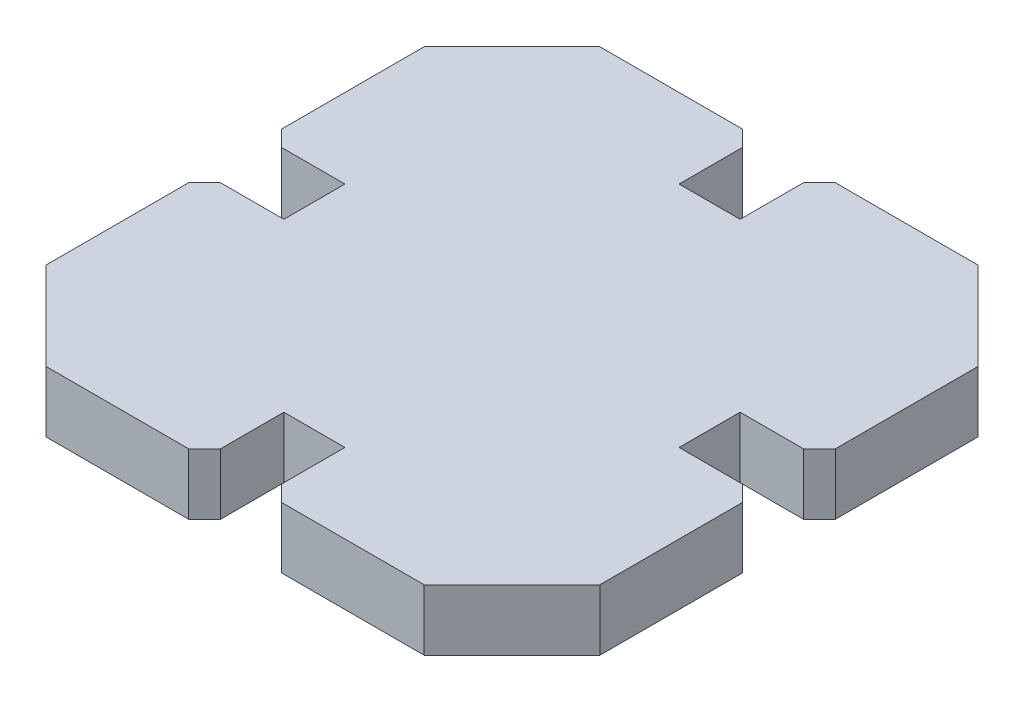
ISO-10303-21;
HEADER;
FILE_DESCRIPTION(('STEP AP214'),'2;1');
FILE_NAME('part.step','',(''),(''),'','','');
FILE_SCHEMA(('AUTOMOTIVE_DESIGN { 1 0 10303 214 1 1 1 1 }'));
ENDSEC;
DATA;
#1=APPLICATION_CONTEXT('core data for automotive mechanical design processes');
#2=APPLICATION_PROTOCOL_DEFINITION('international standard','automotive_design',2000,#1);
#3=PRODUCT_CONTEXT('',#1,'mechanical');
#4=PRODUCT('Part','Part','',(#3));
#5=PRODUCT_RELATED_PRODUCT_CATEGORY('part','',(#4));
#6=PRODUCT_DEFINITION_FORMATION('','',#4);
#7=PRODUCT_DEFINITION_CONTEXT('part definition',#1,'design');
#8=PRODUCT_DEFINITION('design','',#6,#7);
#9=PRODUCT_DEFINITION_SHAPE('','',#8);
#10=(LENGTH_UNIT() NAMED_UNIT(*) SI_UNIT(.MILLI.,.METRE.));
#11=(NAMED_UNIT(*) PLANE_ANGLE_UNIT() SI_UNIT($,.RADIAN.));
#12=(NAMED_UNIT(*) SI_UNIT($,.STERADIAN.) SOLID_ANGLE_UNIT());
#13=UNCERTAINTY_MEASURE_WITH_UNIT(LENGTH_MEASURE(1.E-05),#10,'distance_accuracy_value','');
#14=(GEOMETRIC_REPRESENTATION_CONTEXT(3) GLOBAL_UNCERTAINTY_ASSIGNED_CONTEXT((#13)) GLOBAL_UNIT_ASSIGNED_CONTEXT((#10,
#11,#12)) REPRESENTATION_CONTEXT('',''));
#15=CARTESIAN_POINT('',(0.,0.,0.));
#16=DIRECTION('',(0.,0.,1.));
#17=DIRECTION('',(1.,0.,0.));
#18=AXIS2_PLACEMENT_3D('',#15,#16,#17);
#19=CARTESIAN_POINT('',(11.925,3.85,-17.4607608695652));
#20=DIRECTION('',(-0.707106781186549,0.,0.707106781186546));
#21=DIRECTION('',(0.707106781186546,0.,0.707106781186549));
#22=AXIS2_PLACEMENT_3D('',#19,#20,#21);
#23=PLANE('',#22);
#24=DIRECTION('',(-0.707106781186546,0.,-0.707106781186549));
#25=VECTOR('',#24,1.);
#26=CARTESIAN_POINT('',(11.925,0.,-17.4607608695652));
#27=LINE('',#26,#25);
#28=CARTESIAN_POINT('',(17.4607608695652,0.,-11.9249999999999));
#29=VERTEX_POINT('',#28);
#30=CARTESIAN_POINT('',(11.925,0.,-17.4607608695652));
#31=VERTEX_POINT('',#30);
#32=EDGE_CURVE('E265',#29,#31,#27,.T.);
#33=ORIENTED_EDGE('',*,*,#32,.T.);
#34=DIRECTION('',(0.,-1.,0.));
#35=VECTOR('',#34,1.);
#36=CARTESIAN_POINT('',(11.925,3.85,-17.4607608695652));
#37=LINE('',#36,#35);
#38=CARTESIAN_POINT('',(11.925,3.85,-17.4607608695652));
#39=VERTEX_POINT('',#38);
#40=EDGE_CURVE('E248',#39,#31,#37,.T.);
#41=ORIENTED_EDGE('',*,*,#40,.F.);
#42=DIRECTION('',(-0.707106781186546,0.,-0.707106781186549));
#43=VECTOR('',#42,1.);
#44=CARTESIAN_POINT('',(11.925,3.85,-17.4607608695652));
#45=LINE('',#44,#43);
#46=CARTESIAN_POINT('',(17.4607608695652,3.85,-11.9249999999999));
#47=VERTEX_POINT('',#46);
#48=EDGE_CURVE('E253',#47,#39,#45,.T.);
#49=ORIENTED_EDGE('',*,*,#48,.F.);
#50=DIRECTION('',(0.,-1.,0.));
#51=VECTOR('',#50,1.);
#52=CARTESIAN_POINT('',(17.4607608695652,3.85,-11.9249999999999));
#53=LINE('',#52,#51);
#54=EDGE_CURVE('E403',#47,#29,#53,.T.);
#55=ORIENTED_EDGE('',*,*,#54,.T.);
#56=EDGE_LOOP('',(#33,#41,#49,#55));
#57=FACE_BOUND('',#56,.T.);
#58=ADVANCED_FACE('F33',(#57),#23,.F.);
#59=CARTESIAN_POINT('',(1.92499999999999,3.85,-17.4607608695652));
#60=DIRECTION('',(0.,0.,1.));
#61=DIRECTION('',(1.,0.,0.));
#62=AXIS2_PLACEMENT_3D('',#59,#60,#61);
#63=PLANE('',#62);
#64=DIRECTION('',(-1.,0.,0.));
#65=VECTOR('',#64,1.);
#66=CARTESIAN_POINT('',(1.92499999999999,0.,-17.4607608695652));
#67=LINE('',#66,#65);
#68=CARTESIAN_POINT('',(2.92499999999999,0.,-17.4607608695652));
#69=VERTEX_POINT('',#68);
#70=EDGE_CURVE('E352',#31,#69,#67,.T.);
#71=ORIENTED_EDGE('',*,*,#70,.T.);
#72=DIRECTION('',(0.,1.,0.));
#73=VECTOR('',#72,1.);
#74=CARTESIAN_POINT('',(2.92499999999999,3.85,-17.4607608695652));
#75=LINE('',#74,#73);
#76=CARTESIAN_POINT('',(2.92499999999999,3.85,-17.4607608695652));
#77=VERTEX_POINT('',#76);
#78=EDGE_CURVE('E11',#69,#77,#75,.T.);
#79=ORIENTED_EDGE('',*,*,#78,.T.);
#80=DIRECTION('',(-1.,0.,0.));
#81=VECTOR('',#80,1.);
#82=CARTESIAN_POINT('',(1.92499999999999,3.85,-17.4607608695652));
#83=LINE('',#82,#81);
#84=EDGE_CURVE('E243',#39,#77,#83,.T.);
#85=ORIENTED_EDGE('',*,*,#84,.F.);
#86=ORIENTED_EDGE('',*,*,#40,.T.);
#87=EDGE_LOOP('',(#71,#79,#85,#86));
#88=FACE_BOUND('',#87,.T.);
#89=ADVANCED_FACE('F246',(#88),#63,.F.);
#90=CARTESIAN_POINT('',(1.92499999999999,3.85,-17.4607608695652));
#91=DIRECTION('',(1.,0.,0.));
#92=DIRECTION('',(0.,0.,-1.));
#93=AXIS2_PLACEMENT_3D('',#90,#91,#92);
#94=PLANE('',#93);
#95=DIRECTION('',(0.,0.,1.));
#96=VECTOR('',#95,1.);
#97=CARTESIAN_POINT('',(1.92499999999999,3.85,-17.4607608695652));
#98=LINE('',#97,#96);
#99=CARTESIAN_POINT('',(1.92500000000007,3.85,-16.4607608695653));
#100=VERTEX_POINT('',#99);
#101=CARTESIAN_POINT('',(1.92500000000037,3.85,-12.4607608695653));
#102=VERTEX_POINT('',#101);
#103=EDGE_CURVE('E252',#100,#102,#98,.T.);
#104=ORIENTED_EDGE('',*,*,#103,.F.);
#105=DIRECTION('',(0.,-1.,0.));
#106=VECTOR('',#105,1.);
#107=CARTESIAN_POINT('',(1.92500000000007,3.85,-16.4607608695653));
#108=LINE('',#107,#106);
#109=CARTESIAN_POINT('',(1.92500000000007,0.,-16.4607608695653));
#110=VERTEX_POINT('',#109);
#111=EDGE_CURVE('E41',#100,#110,#108,.T.);
#112=ORIENTED_EDGE('',*,*,#111,.T.);
#113=DIRECTION('',(0.,0.,1.));
#114=VECTOR('',#113,1.);
#115=CARTESIAN_POINT('',(1.92499999999999,0.,-17.4607608695652));
#116=LINE('',#115,#114);
#117=CARTESIAN_POINT('',(1.92500000000037,0.,-12.4607608695653));
#118=VERTEX_POINT('',#117);
#119=EDGE_CURVE('E344',#110,#118,#116,.T.);
#120=ORIENTED_EDGE('',*,*,#119,.T.);
#121=DIRECTION('',(0.,-1.,0.));
#122=VECTOR('',#121,1.);
#123=CARTESIAN_POINT('',(1.92500000000037,3.85,-12.4607608695653));
#124=LINE('',#123,#122);
#125=EDGE_CURVE('E267',#102,#118,#124,.T.);
#126=ORIENTED_EDGE('',*,*,#125,.F.);
#127=EDGE_LOOP('',(#104,#112,#120,#126));
#128=FACE_BOUND('',#127,.T.);
#129=ADVANCED_FACE('F342',(#128),#94,.F.);
#130=CARTESIAN_POINT('',(-1.92499999999964,3.85,-12.4607608695653));
#131=DIRECTION('',(0.,0.,1.));
#132=DIRECTION('',(1.,0.,0.));
#133=AXIS2_PLACEMENT_3D('',#130,#131,#132);
#134=PLANE('',#133);
#135=DIRECTION('',(-1.,0.,0.));
#136=VECTOR('',#135,1.);
#137=CARTESIAN_POINT('',(-1.92499999999964,0.,-12.4607608695653));
#138=LINE('',#137,#136);
#139=CARTESIAN_POINT('',(-1.92499999999964,0.,-12.4607608695653));
#140=VERTEX_POINT('',#139);
#141=EDGE_CURVE('E351',#118,#140,#138,.T.);
#142=ORIENTED_EDGE('',*,*,#141,.T.);
#143=DIRECTION('',(0.,-1.,0.));
#144=VECTOR('',#143,1.);
#145=CARTESIAN_POINT('',(-1.92499999999964,3.85,-12.4607608695653));
#146=LINE('',#145,#144);
#147=CARTESIAN_POINT('',(-1.92499999999964,3.85,-12.4607608695653));
#148=VERTEX_POINT('',#147);
#149=EDGE_CURVE('E273',#148,#140,#146,.T.);
#150=ORIENTED_EDGE('',*,*,#149,.F.);
#151=DIRECTION('',(-1.,0.,0.));
#152=VECTOR('',#151,1.);
#153=CARTESIAN_POINT('',(-1.92499999999964,3.85,-12.4607608695653));
#154=LINE('',#153,#152);
#155=EDGE_CURVE('E466',#102,#148,#154,.T.);
#156=ORIENTED_EDGE('',*,*,#155,.F.);
#157=ORIENTED_EDGE('',*,*,#125,.T.);
#158=EDGE_LOOP('',(#142,#150,#156,#157));
#159=FACE_BOUND('',#158,.T.);
#160=ADVANCED_FACE('F515',(#159),#134,.F.);
#161=CARTESIAN_POINT('',(-1.925,3.85,-17.4607608695652));
#162=DIRECTION('',(-1.,0.,0.));
#163=DIRECTION('',(0.,0.,1.));
#164=AXIS2_PLACEMENT_3D('',#161,#162,#163);
#165=PLANE('',#164);
#166=DIRECTION('',(0.,0.,-1.));
#167=VECTOR('',#166,1.);
#168=CARTESIAN_POINT('',(-1.925,0.,-17.4607608695652));
#169=LINE('',#168,#167);
#170=CARTESIAN_POINT('',(-1.92499999999992,0.,-16.4607608695652));
#171=VERTEX_POINT('',#170);
#172=EDGE_CURVE('E354',#140,#171,#169,.T.);
#173=ORIENTED_EDGE('',*,*,#172,.T.);
#174=DIRECTION('',(0.,1.,0.));
#175=VECTOR('',#174,1.);
#176=CARTESIAN_POINT('',(-1.92499999999992,3.85,-16.4607608695652));
#177=LINE('',#176,#175);
#178=CARTESIAN_POINT('',(-1.92499999999992,3.85,-16.4607608695652));
#179=VERTEX_POINT('',#178);
#180=EDGE_CURVE('E336',#171,#179,#177,.T.);
#181=ORIENTED_EDGE('',*,*,#180,.T.);
#182=DIRECTION('',(0.,0.,-1.));
#183=VECTOR('',#182,1.);
#184=CARTESIAN_POINT('',(-1.925,3.85,-17.4607608695652));
#185=LINE('',#184,#183);
#186=EDGE_CURVE('E447',#148,#179,#185,.T.);
#187=ORIENTED_EDGE('',*,*,#186,.F.);
#188=ORIENTED_EDGE('',*,*,#149,.T.);
#189=EDGE_LOOP('',(#173,#181,#187,#188));
#190=FACE_BOUND('',#189,.T.);
#191=ADVANCED_FACE('F444',(#190),#165,.F.);
#192=CARTESIAN_POINT('',(-1.925,3.85,-17.4607608695652));
#193=DIRECTION('',(0.,0.,1.));
#194=DIRECTION('',(1.,0.,0.));
#195=AXIS2_PLACEMENT_3D('',#192,#193,#194);
#196=PLANE('',#195);
#197=DIRECTION('',(-1.,0.,0.));
#198=VECTOR('',#197,1.);
#199=CARTESIAN_POINT('',(-1.925,3.85,-17.4607608695652));
#200=LINE('',#199,#198);
#201=CARTESIAN_POINT('',(-2.92500000000007,3.85,-17.4607608695652));
#202=VERTEX_POINT('',#201);
#203=CARTESIAN_POINT('',(-11.925,3.85,-17.4607608695652));
#204=VERTEX_POINT('',#203);
#205=EDGE_CURVE('E460',#202,#204,#200,.T.);
#206=ORIENTED_EDGE('',*,*,#205,.F.);
#207=DIRECTION('',(0.,-1.,0.));
#208=VECTOR('',#207,1.);
#209=CARTESIAN_POINT('',(-2.92500000000007,3.85,-17.4607608695652));
#210=LINE('',#209,#208);
#211=CARTESIAN_POINT('',(-2.92500000000007,0.,-17.4607608695652));
#212=VERTEX_POINT('',#211);
#213=EDGE_CURVE('E333',#202,#212,#210,.T.);
#214=ORIENTED_EDGE('',*,*,#213,.T.);
#215=DIRECTION('',(-1.,0.,0.));
#216=VECTOR('',#215,1.);
#217=CARTESIAN_POINT('',(-1.925,0.,-17.4607608695652));
#218=LINE('',#217,#216);
#219=CARTESIAN_POINT('',(-11.925,0.,-17.4607608695652));
#220=VERTEX_POINT('',#219);
#221=EDGE_CURVE('E361',#212,#220,#218,.T.);
#222=ORIENTED_EDGE('',*,*,#221,.T.);
#223=DIRECTION('',(0.,-1.,0.));
#224=VECTOR('',#223,1.);
#225=CARTESIAN_POINT('',(-11.925,3.85,-17.4607608695652));
#226=LINE('',#225,#224);
#227=EDGE_CURVE('E438',#204,#220,#226,.T.);
#228=ORIENTED_EDGE('',*,*,#227,.F.);
#229=EDGE_LOOP('',(#206,#214,#222,#228));
#230=FACE_BOUND('',#229,.T.);
#231=ADVANCED_FACE('F458',(#230),#196,.F.);
#232=CARTESIAN_POINT('',(-17.4607608695651,3.85,-11.9250000000002));
#233=DIRECTION('',(0.707106781186543,0.,0.707106781186552));
#234=DIRECTION('',(0.707106781186552,0.,-0.707106781186543));
#235=AXIS2_PLACEMENT_3D('',#232,#233,#234);
#236=PLANE('',#235);
#237=DIRECTION('',(-0.707106781186552,0.,0.707106781186543));
#238=VECTOR('',#237,1.);
#239=CARTESIAN_POINT('',(-17.4607608695651,0.,-11.9250000000002));
#240=LINE('',#239,#238);
#241=CARTESIAN_POINT('',(-17.4607608695651,0.,-11.9250000000002));
#242=VERTEX_POINT('',#241);
#243=EDGE_CURVE('E363',#220,#242,#240,.T.);
#244=ORIENTED_EDGE('',*,*,#243,.T.);
#245=DIRECTION('',(0.,-1.,0.));
#246=VECTOR('',#245,1.);
#247=CARTESIAN_POINT('',(-17.4607608695651,3.85,-11.9250000000002));
#248=LINE('',#247,#246);
#249=CARTESIAN_POINT('',(-17.4607608695651,3.85,-11.9250000000002));
#250=VERTEX_POINT('',#249);
#251=EDGE_CURVE('E435',#250,#242,#248,.T.);
#252=ORIENTED_EDGE('',*,*,#251,.F.);
#253=DIRECTION('',(-0.707106781186552,0.,0.707106781186543));
#254=VECTOR('',#253,1.);
#255=CARTESIAN_POINT('',(-17.4607608695651,3.85,-11.9250000000002));
#256=LINE('',#255,#254);
#257=EDGE_CURVE('E462',#204,#250,#256,.T.);
#258=ORIENTED_EDGE('',*,*,#257,.F.);
#259=ORIENTED_EDGE('',*,*,#227,.T.);
#260=EDGE_LOOP('',(#244,#252,#258,#259));
#261=FACE_BOUND('',#260,.T.);
#262=ADVANCED_FACE('F746',(#261),#236,.F.);
#263=CARTESIAN_POINT('',(-17.4607608695652,3.85,-1.92500000000017));
#264=DIRECTION('',(1.,0.,0.));
#265=DIRECTION('',(0.,0.,-1.));
#266=AXIS2_PLACEMENT_3D('',#263,#264,#265);
#267=PLANE('',#266);
#268=DIRECTION('',(0.,0.,1.));
#269=VECTOR('',#268,1.);
#270=CARTESIAN_POINT('',(-17.4607608695652,0.,-1.92500000000017));
#271=LINE('',#270,#269);
#272=CARTESIAN_POINT('',(-17.4607608695652,0.,-2.92500000000017));
#273=VERTEX_POINT('',#272);
#274=EDGE_CURVE('E365',#242,#273,#271,.T.);
#275=ORIENTED_EDGE('',*,*,#274,.T.);
#276=DIRECTION('',(0.,1.,0.));
#277=VECTOR('',#276,1.);
#278=CARTESIAN_POINT('',(-17.4607608695652,3.85,-2.92500000000017));
#279=LINE('',#278,#277);
#280=CARTESIAN_POINT('',(-17.4607608695652,3.85,-2.92500000000017));
#281=VERTEX_POINT('',#280);
#282=EDGE_CURVE('E331',#273,#281,#279,.T.);
#283=ORIENTED_EDGE('',*,*,#282,.T.);
#284=DIRECTION('',(0.,0.,1.));
#285=VECTOR('',#284,1.);
#286=CARTESIAN_POINT('',(-17.4607608695652,3.85,-1.92500000000017));
#287=LINE('',#286,#285);
#288=EDGE_CURVE('E464',#250,#281,#287,.T.);
#289=ORIENTED_EDGE('',*,*,#288,.F.);
#290=ORIENTED_EDGE('',*,*,#251,.T.);
#291=EDGE_LOOP('',(#275,#283,#289,#290));
#292=FACE_BOUND('',#291,.T.);
#293=ADVANCED_FACE('F736',(#292),#267,.F.);
#294=CARTESIAN_POINT('',(-17.4607608695652,3.85,-1.92500000000017));
#295=DIRECTION('',(0.,0.,-1.));
#296=DIRECTION('',(-1.,0.,0.));
#297=AXIS2_PLACEMENT_3D('',#294,#295,#296);
#298=PLANE('',#297);
#299=DIRECTION('',(1.,0.,0.));
#300=VECTOR('',#299,1.);
#301=CARTESIAN_POINT('',(-17.4607608695652,3.85,-1.92500000000017));
#302=LINE('',#301,#300);
#303=CARTESIAN_POINT('',(-16.4607608695652,3.85,-1.92500000000015));
#304=VERTEX_POINT('',#303);
#305=CARTESIAN_POINT('',(-12.4607608695649,3.85,-1.92500000000006));
#306=VERTEX_POINT('',#305);
#307=EDGE_CURVE('E472',#304,#306,#302,.T.);
#308=ORIENTED_EDGE('',*,*,#307,.F.);
#309=DIRECTION('',(0.,-1.,0.));
#310=VECTOR('',#309,1.);
#311=CARTESIAN_POINT('',(-16.4607608695652,3.85,-1.92500000000015));
#312=LINE('',#311,#310);
#313=CARTESIAN_POINT('',(-16.4607608695652,0.,-1.92500000000015));
#314=VERTEX_POINT('',#313);
#315=EDGE_CURVE('E328',#304,#314,#312,.T.);
#316=ORIENTED_EDGE('',*,*,#315,.T.);
#317=DIRECTION('',(1.,0.,0.));
#318=VECTOR('',#317,1.);
#319=CARTESIAN_POINT('',(-17.4607608695652,0.,-1.92500000000017));
#320=LINE('',#319,#318);
#321=CARTESIAN_POINT('',(-12.4607608695649,0.,-1.92500000000006));
#322=VERTEX_POINT('',#321);
#323=EDGE_CURVE('E368',#314,#322,#320,.T.);
#324=ORIENTED_EDGE('',*,*,#323,.T.);
#325=DIRECTION('',(0.,-1.,0.));
#326=VECTOR('',#325,1.);
#327=CARTESIAN_POINT('',(-12.4607608695649,3.85,-1.92500000000006));
#328=LINE('',#327,#326);
#329=EDGE_CURVE('E432',#306,#322,#328,.T.);
#330=ORIENTED_EDGE('',*,*,#329,.F.);
#331=EDGE_LOOP('',(#308,#316,#324,#330));
#332=FACE_BOUND('',#331,.T.);
#333=ADVANCED_FACE('F731',(#332),#298,.F.);
#334=CARTESIAN_POINT('',(-12.4607608695649,3.85,1.92499999999994));
#335=DIRECTION('',(1.,0.,0.));
#336=DIRECTION('',(0.,0.,-1.));
#337=AXIS2_PLACEMENT_3D('',#334,#335,#336);
#338=PLANE('',#337);
#339=DIRECTION('',(0.,0.,1.));
#340=VECTOR('',#339,1.);
#341=CARTESIAN_POINT('',(-12.4607608695649,0.,1.92499999999994));
#342=LINE('',#341,#340);
#343=CARTESIAN_POINT('',(-12.4607608695649,0.,1.92499999999994));
#344=VERTEX_POINT('',#343);
#345=EDGE_CURVE('E370',#322,#344,#342,.T.);
#346=ORIENTED_EDGE('',*,*,#345,.T.);
#347=DIRECTION('',(0.,-1.,0.));
#348=VECTOR('',#347,1.);
#349=CARTESIAN_POINT('',(-12.4607608695649,3.85,1.92499999999994));
#350=LINE('',#349,#348);
#351=CARTESIAN_POINT('',(-12.4607608695649,3.85,1.92499999999994));
#352=VERTEX_POINT('',#351);
#353=EDGE_CURVE('E429',#352,#344,#350,.T.);
#354=ORIENTED_EDGE('',*,*,#353,.F.);
#355=DIRECTION('',(0.,0.,1.));
#356=VECTOR('',#355,1.);
#357=CARTESIAN_POINT('',(-12.4607608695649,3.85,1.92499999999994));
#358=LINE('',#357,#356);
#359=EDGE_CURVE('E474',#306,#352,#358,.T.);
#360=ORIENTED_EDGE('',*,*,#359,.F.);
#361=ORIENTED_EDGE('',*,*,#329,.T.);
#362=EDGE_LOOP('',(#346,#354,#360,#361));
#363=FACE_BOUND('',#362,.T.);
#364=ADVANCED_FACE('F723',(#363),#338,.F.);
#365=CARTESIAN_POINT('',(-17.4607608695652,3.85,1.92499999999981));
#366=DIRECTION('',(0.,0.,1.));
#367=DIRECTION('',(1.,0.,0.));
#368=AXIS2_PLACEMENT_3D('',#365,#366,#367);
#369=PLANE('',#368);
#370=DIRECTION('',(-1.,0.,0.));
#371=VECTOR('',#370,1.);
#372=CARTESIAN_POINT('',(-17.4607608695652,0.,1.92499999999981));
#373=LINE('',#372,#371);
#374=CARTESIAN_POINT('',(-16.4607608695652,0.,1.92499999999984));
#375=VERTEX_POINT('',#374);
#376=EDGE_CURVE('E372',#344,#375,#373,.T.);
#377=ORIENTED_EDGE('',*,*,#376,.T.);
#378=DIRECTION('',(0.,1.,0.));
#379=VECTOR('',#378,1.);
#380=CARTESIAN_POINT('',(-16.4607608695652,3.85,1.92499999999984));
#381=LINE('',#380,#379);
#382=CARTESIAN_POINT('',(-16.4607608695652,3.85,1.92499999999984));
#383=VERTEX_POINT('',#382);
#384=EDGE_CURVE('E326',#375,#383,#381,.T.);
#385=ORIENTED_EDGE('',*,*,#384,.T.);
#386=DIRECTION('',(-1.,0.,0.));
#387=VECTOR('',#386,1.);
#388=CARTESIAN_POINT('',(-17.4607608695652,3.85,1.92499999999981));
#389=LINE('',#388,#387);
#390=EDGE_CURVE('E476',#352,#383,#389,.T.);
#391=ORIENTED_EDGE('',*,*,#390,.F.);
#392=ORIENTED_EDGE('',*,*,#353,.T.);
#393=EDGE_LOOP('',(#377,#385,#391,#392));
#394=FACE_BOUND('',#393,.T.);
#395=ADVANCED_FACE('F713',(#394),#369,.F.);
#396=CARTESIAN_POINT('',(-17.4607608695652,3.85,1.92499999999981));
#397=DIRECTION('',(1.,0.,0.));
#398=DIRECTION('',(0.,0.,-1.));
#399=AXIS2_PLACEMENT_3D('',#396,#397,#398);
#400=PLANE('',#399);
#401=DIRECTION('',(0.,0.,1.));
#402=VECTOR('',#401,1.);
#403=CARTESIAN_POINT('',(-17.4607608695652,3.85,1.92499999999981));
#404=LINE('',#403,#402);
#405=CARTESIAN_POINT('',(-17.4607608695652,3.85,2.92499999999975));
#406=VERTEX_POINT('',#405);
#407=CARTESIAN_POINT('',(-17.4607608695648,3.85,11.9250000000003));
#408=VERTEX_POINT('',#407);
#409=EDGE_CURVE('E479',#406,#408,#404,.T.);
#410=ORIENTED_EDGE('',*,*,#409,.F.);
#411=DIRECTION('',(0.,-1.,0.));
#412=VECTOR('',#411,1.);
#413=CARTESIAN_POINT('',(-17.4607608695652,3.85,2.92499999999975));
#414=LINE('',#413,#412);
#415=CARTESIAN_POINT('',(-17.4607608695652,0.,2.92499999999975));
#416=VERTEX_POINT('',#415);
#417=EDGE_CURVE('E323',#406,#416,#414,.T.);
#418=ORIENTED_EDGE('',*,*,#417,.T.);
#419=DIRECTION('',(0.,0.,1.));
#420=VECTOR('',#419,1.);
#421=CARTESIAN_POINT('',(-17.4607608695652,0.,1.92499999999981));
#422=LINE('',#421,#420);
#423=CARTESIAN_POINT('',(-17.4607608695648,0.,11.9250000000003));
#424=VERTEX_POINT('',#423);
#425=EDGE_CURVE('E375',#416,#424,#422,.T.);
#426=ORIENTED_EDGE('',*,*,#425,.T.);
#427=DIRECTION('',(0.,-1.,0.));
#428=VECTOR('',#427,1.);
#429=CARTESIAN_POINT('',(-17.4607608695648,3.85,11.9250000000003));
#430=LINE('',#429,#428);
#431=EDGE_CURVE('E426',#408,#424,#430,.T.);
#432=ORIENTED_EDGE('',*,*,#431,.F.);
#433=EDGE_LOOP('',(#410,#418,#426,#432));
#434=FACE_BOUND('',#433,.T.);
#435=ADVANCED_FACE('F708',(#434),#400,.F.);
#436=CARTESIAN_POINT('',(-11.9249999999993,3.85,17.4607608695651));
#437=DIRECTION('',(0.707106781186503,0.,-0.707106781186592));
#438=DIRECTION('',(-0.707106781186592,0.,-0.707106781186503));
#439=AXIS2_PLACEMENT_3D('',#436,#437,#438);
#440=PLANE('',#439);
#441=DIRECTION('',(0.707106781186592,0.,0.707106781186503));
#442=VECTOR('',#441,1.);
#443=CARTESIAN_POINT('',(-11.9249999999993,0.,17.4607608695651));
#444=LINE('',#443,#442);
#445=CARTESIAN_POINT('',(-11.9249999999993,0.,17.4607608695651));
#446=VERTEX_POINT('',#445);
#447=EDGE_CURVE('E377',#424,#446,#444,.T.);
#448=ORIENTED_EDGE('',*,*,#447,.T.);
#449=DIRECTION('',(0.,-1.,0.));
#450=VECTOR('',#449,1.);
#451=CARTESIAN_POINT('',(-11.9249999999993,3.85,17.4607608695651));
#452=LINE('',#451,#450);
#453=CARTESIAN_POINT('',(-11.9249999999993,3.85,17.4607608695651));
#454=VERTEX_POINT('',#453);
#455=EDGE_CURVE('E423',#454,#446,#452,.T.);
#456=ORIENTED_EDGE('',*,*,#455,.F.);
#457=DIRECTION('',(0.707106781186592,0.,0.707106781186503));
#458=VECTOR('',#457,1.);
#459=CARTESIAN_POINT('',(-11.9249999999993,3.85,17.4607608695651));
#460=LINE('',#459,#458);
#461=EDGE_CURVE('E481',#408,#454,#460,.T.);
#462=ORIENTED_EDGE('',*,*,#461,.F.);
#463=ORIENTED_EDGE('',*,*,#431,.T.);
#464=EDGE_LOOP('',(#448,#456,#462,#463));
#465=FACE_BOUND('',#464,.T.);
#466=ADVANCED_FACE('F700',(#465),#440,.F.);
#467=CARTESIAN_POINT('',(-1.92499999999929,3.85,17.4607608695651));
#468=DIRECTION('',(0.,0.,-1.));
#469=DIRECTION('',(-1.,0.,0.));
#470=AXIS2_PLACEMENT_3D('',#467,#468,#469);
#471=PLANE('',#470);
#472=DIRECTION('',(1.,0.,0.));
#473=VECTOR('',#472,1.);
#474=CARTESIAN_POINT('',(-1.92499999999929,0.,17.4607608695651));
#475=LINE('',#474,#473);
#476=CARTESIAN_POINT('',(-2.9249999999993,0.,17.4607608695651));
#477=VERTEX_POINT('',#476);
#478=EDGE_CURVE('E379',#446,#477,#475,.T.);
#479=ORIENTED_EDGE('',*,*,#478,.T.);
#480=DIRECTION('',(0.,1.,0.));
#481=VECTOR('',#480,1.);
#482=CARTESIAN_POINT('',(-2.9249999999993,3.85,17.4607608695651));
#483=LINE('',#482,#481);
#484=CARTESIAN_POINT('',(-2.9249999999993,3.85,17.4607608695651));
#485=VERTEX_POINT('',#484);
#486=EDGE_CURVE('E321',#477,#485,#483,.T.);
#487=ORIENTED_EDGE('',*,*,#486,.T.);
#488=DIRECTION('',(1.,0.,0.));
#489=VECTOR('',#488,1.);
#490=CARTESIAN_POINT('',(-1.92499999999929,3.85,17.4607608695651));
#491=LINE('',#490,#489);
#492=EDGE_CURVE('E483',#454,#485,#491,.T.);
#493=ORIENTED_EDGE('',*,*,#492,.F.);
#494=ORIENTED_EDGE('',*,*,#455,.T.);
#495=EDGE_LOOP('',(#479,#487,#493,#494));
#496=FACE_BOUND('',#495,.T.);
#497=ADVANCED_FACE('F690',(#496),#471,.F.);
#498=CARTESIAN_POINT('',(-1.92499999999929,3.85,17.4607608695651));
#499=DIRECTION('',(-1.,0.,0.));
#500=DIRECTION('',(0.,0.,1.));
#501=AXIS2_PLACEMENT_3D('',#498,#499,#500);
#502=PLANE('',#501);
#503=DIRECTION('',(0.,0.,-1.));
#504=VECTOR('',#503,1.);
#505=CARTESIAN_POINT('',(-1.92499999999929,3.85,17.4607608695651));
#506=LINE('',#505,#504);
#507=CARTESIAN_POINT('',(-1.92499999999937,3.85,16.4607608695652));
#508=VERTEX_POINT('',#507);
#509=CARTESIAN_POINT('',(-1.92499999999967,3.85,12.4607608695652));
#510=VERTEX_POINT('',#509);
#511=EDGE_CURVE('E486',#508,#510,#506,.T.);
#512=ORIENTED_EDGE('',*,*,#511,.F.);
#513=DIRECTION('',(0.,-1.,0.));
#514=VECTOR('',#513,1.);
#515=CARTESIAN_POINT('',(-1.92499999999937,3.85,16.4607608695652));
#516=LINE('',#515,#514);
#517=CARTESIAN_POINT('',(-1.92499999999937,0.,16.4607608695652));
#518=VERTEX_POINT('',#517);
#519=EDGE_CURVE('E318',#508,#518,#516,.T.);
#520=ORIENTED_EDGE('',*,*,#519,.T.);
#521=DIRECTION('',(0.,0.,-1.));
#522=VECTOR('',#521,1.);
#523=CARTESIAN_POINT('',(-1.92499999999929,0.,17.4607608695651));
#524=LINE('',#523,#522);
#525=CARTESIAN_POINT('',(-1.92499999999967,0.,12.4607608695652));
#526=VERTEX_POINT('',#525);
#527=EDGE_CURVE('E382',#518,#526,#524,.T.);
#528=ORIENTED_EDGE('',*,*,#527,.T.);
#529=DIRECTION('',(0.,-1.,0.));
#530=VECTOR('',#529,1.);
#531=CARTESIAN_POINT('',(-1.92499999999967,3.85,12.4607608695652));
#532=LINE('',#531,#530);
#533=EDGE_CURVE('E420',#510,#526,#532,.T.);
#534=ORIENTED_EDGE('',*,*,#533,.F.);
#535=EDGE_LOOP('',(#512,#520,#528,#534));
#536=FACE_BOUND('',#535,.T.);
#537=ADVANCED_FACE('F685',(#536),#502,.F.);
#538=CARTESIAN_POINT('',(1.92500000000033,3.85,12.4607608695652));
#539=DIRECTION('',(0.,0.,-1.));
#540=DIRECTION('',(-1.,0.,0.));
#541=AXIS2_PLACEMENT_3D('',#538,#539,#540);
#542=PLANE('',#541);
#543=DIRECTION('',(1.,0.,0.));
#544=VECTOR('',#543,1.);
#545=CARTESIAN_POINT('',(1.92500000000033,0.,12.4607608695652));
#546=LINE('',#545,#544);
#547=CARTESIAN_POINT('',(1.92500000000033,0.,12.4607608695652));
#548=VERTEX_POINT('',#547);
#549=EDGE_CURVE('E384',#526,#548,#546,.T.);
#550=ORIENTED_EDGE('',*,*,#549,.T.);
#551=DIRECTION('',(0.,-1.,0.));
#552=VECTOR('',#551,1.);
#553=CARTESIAN_POINT('',(1.92500000000033,3.85,12.4607608695652));
#554=LINE('',#553,#552);
#555=CARTESIAN_POINT('',(1.92500000000033,3.85,12.4607608695652));
#556=VERTEX_POINT('',#555);
#557=EDGE_CURVE('E417',#556,#548,#554,.T.);
#558=ORIENTED_EDGE('',*,*,#557,.F.);
#559=DIRECTION('',(1.,0.,0.));
#560=VECTOR('',#559,1.);
#561=CARTESIAN_POINT('',(1.92500000000033,3.85,12.4607608695652));
#562=LINE('',#561,#560);
#563=EDGE_CURVE('E488',#510,#556,#562,.T.);
#564=ORIENTED_EDGE('',*,*,#563,.F.);
#565=ORIENTED_EDGE('',*,*,#533,.T.);
#566=EDGE_LOOP('',(#550,#558,#564,#565));
#567=FACE_BOUND('',#566,.T.);
#568=ADVANCED_FACE('F677',(#567),#542,.F.);
#569=CARTESIAN_POINT('',(1.9250000000007,3.85,17.4607608695651));
#570=DIRECTION('',(1.,0.,0.));
#571=DIRECTION('',(0.,0.,-1.));
#572=AXIS2_PLACEMENT_3D('',#569,#570,#571);
#573=PLANE('',#572);
#574=DIRECTION('',(0.,0.,1.));
#575=VECTOR('',#574,1.);
#576=CARTESIAN_POINT('',(1.9250000000007,0.,17.4607608695651));
#577=LINE('',#576,#575);
#578=CARTESIAN_POINT('',(1.92500000000062,0.,16.4607608695651));
#579=VERTEX_POINT('',#578);
#580=EDGE_CURVE('E386',#548,#579,#577,.T.);
#581=ORIENTED_EDGE('',*,*,#580,.T.);
#582=DIRECTION('',(0.,1.,0.));
#583=VECTOR('',#582,1.);
#584=CARTESIAN_POINT('',(1.92500000000062,3.85,16.4607608695651));
#585=LINE('',#584,#583);
#586=CARTESIAN_POINT('',(1.92500000000062,3.85,16.4607608695651));
#587=VERTEX_POINT('',#586);
#588=EDGE_CURVE('E316',#579,#587,#585,.T.);
#589=ORIENTED_EDGE('',*,*,#588,.T.);
#590=DIRECTION('',(0.,0.,1.));
#591=VECTOR('',#590,1.);
#592=CARTESIAN_POINT('',(1.9250000000007,3.85,17.4607608695651));
#593=LINE('',#592,#591);
#594=EDGE_CURVE('E490',#556,#587,#593,.T.);
#595=ORIENTED_EDGE('',*,*,#594,.F.);
#596=ORIENTED_EDGE('',*,*,#557,.T.);
#597=EDGE_LOOP('',(#581,#589,#595,#596));
#598=FACE_BOUND('',#597,.T.);
#599=ADVANCED_FACE('F667',(#598),#573,.F.);
#600=CARTESIAN_POINT('',(1.9250000000007,3.85,17.4607608695651));
#601=DIRECTION('',(0.,0.,-1.));
#602=DIRECTION('',(-1.,0.,0.));
#603=AXIS2_PLACEMENT_3D('',#600,#601,#602);
#604=PLANE('',#603);
#605=DIRECTION('',(1.,0.,0.));
#606=VECTOR('',#605,1.);
#607=CARTESIAN_POINT('',(1.9250000000007,3.85,17.4607608695651));
#608=LINE('',#607,#606);
#609=CARTESIAN_POINT('',(2.92500000000077,3.85,17.4607608695651));
#610=VERTEX_POINT('',#609);
#611=CARTESIAN_POINT('',(11.9250000000007,3.85,17.4607608695651));
#612=VERTEX_POINT('',#611);
#613=EDGE_CURVE('E493',#610,#612,#608,.T.);
#614=ORIENTED_EDGE('',*,*,#613,.F.);
#615=DIRECTION('',(0.,-1.,0.));
#616=VECTOR('',#615,1.);
#617=CARTESIAN_POINT('',(2.92500000000077,3.85,17.4607608695651));
#618=LINE('',#617,#616);
#619=CARTESIAN_POINT('',(2.92500000000077,0.,17.4607608695651));
#620=VERTEX_POINT('',#619);
#621=EDGE_CURVE('E313',#610,#620,#618,.T.);
#622=ORIENTED_EDGE('',*,*,#621,.T.);
#623=DIRECTION('',(1.,0.,0.));
#624=VECTOR('',#623,1.);
#625=CARTESIAN_POINT('',(1.9250000000007,0.,17.4607608695651));
#626=LINE('',#625,#624);
#627=CARTESIAN_POINT('',(11.9250000000007,0.,17.4607608695651));
#628=VERTEX_POINT('',#627);
#629=EDGE_CURVE('E389',#620,#628,#626,.T.);
#630=ORIENTED_EDGE('',*,*,#629,.T.);
#631=DIRECTION('',(0.,-1.,0.));
#632=VECTOR('',#631,1.);
#633=CARTESIAN_POINT('',(11.9250000000007,3.85,17.4607608695651));
#634=LINE('',#633,#632);
#635=EDGE_CURVE('E414',#612,#628,#634,.T.);
#636=ORIENTED_EDGE('',*,*,#635,.F.);
#637=EDGE_LOOP('',(#614,#622,#630,#636));
#638=FACE_BOUND('',#637,.T.);
#639=ADVANCED_FACE('F662',(#638),#604,.F.);
#640=CARTESIAN_POINT('',(17.4607608695652,3.85,11.9250000000001));
#641=DIRECTION('',(-0.707106781186584,0.,-0.707106781186511));
#642=DIRECTION('',(-0.707106781186511,0.,0.707106781186584));
#643=AXIS2_PLACEMENT_3D('',#640,#641,#642);
#644=PLANE('',#643);
#645=DIRECTION('',(0.707106781186511,0.,-0.707106781186584));
#646=VECTOR('',#645,1.);
#647=CARTESIAN_POINT('',(17.4607608695652,0.,11.9250000000001));
#648=LINE('',#647,#646);
#649=CARTESIAN_POINT('',(17.4607608695652,0.,11.9250000000001));
#650=VERTEX_POINT('',#649);
#651=EDGE_CURVE('E391',#628,#650,#648,.T.);
#652=ORIENTED_EDGE('',*,*,#651,.T.);
#653=DIRECTION('',(0.,-1.,0.));
#654=VECTOR('',#653,1.);
#655=CARTESIAN_POINT('',(17.4607608695652,3.85,11.9250000000001));
#656=LINE('',#655,#654);
#657=CARTESIAN_POINT('',(17.4607608695652,3.85,11.9250000000001));
#658=VERTEX_POINT('',#657);
#659=EDGE_CURVE('E411',#658,#650,#656,.T.);
#660=ORIENTED_EDGE('',*,*,#659,.F.);
#661=DIRECTION('',(0.707106781186511,0.,-0.707106781186584));
#662=VECTOR('',#661,1.);
#663=CARTESIAN_POINT('',(17.4607608695652,3.85,11.9250000000001));
#664=LINE('',#663,#662);
#665=EDGE_CURVE('E495',#612,#658,#664,.T.);
#666=ORIENTED_EDGE('',*,*,#665,.F.);
#667=ORIENTED_EDGE('',*,*,#635,.T.);
#668=EDGE_LOOP('',(#652,#660,#666,#667));
#669=FACE_BOUND('',#668,.T.);
#670=ADVANCED_FACE('F654',(#669),#644,.F.);
#671=CARTESIAN_POINT('',(17.4607608695652,3.85,1.92500000000005));
#672=DIRECTION('',(-1.,0.,0.));
#673=DIRECTION('',(0.,0.,1.));
#674=AXIS2_PLACEMENT_3D('',#671,#672,#673);
#675=PLANE('',#674);
#676=DIRECTION('',(0.,0.,-1.));
#677=VECTOR('',#676,1.);
#678=CARTESIAN_POINT('',(17.4607608695652,0.,1.92500000000005));
#679=LINE('',#678,#677);
#680=CARTESIAN_POINT('',(17.4607608695652,0.,2.92500000000006));
#681=VERTEX_POINT('',#680);
#682=EDGE_CURVE('E393',#650,#681,#679,.T.);
#683=ORIENTED_EDGE('',*,*,#682,.T.);
#684=DIRECTION('',(0.,1.,0.));
#685=VECTOR('',#684,1.);
#686=CARTESIAN_POINT('',(17.4607608695652,3.85,2.92500000000006));
#687=LINE('',#686,#685);
#688=CARTESIAN_POINT('',(17.4607608695652,3.85,2.92500000000006));
#689=VERTEX_POINT('',#688);
#690=EDGE_CURVE('E292',#681,#689,#687,.T.);
#691=ORIENTED_EDGE('',*,*,#690,.T.);
#692=DIRECTION('',(0.,0.,-1.));
#693=VECTOR('',#692,1.);
#694=CARTESIAN_POINT('',(17.4607608695652,3.85,1.92500000000005));
#695=LINE('',#694,#693);
#696=EDGE_CURVE('E497',#658,#689,#695,.T.);
#697=ORIENTED_EDGE('',*,*,#696,.F.);
#698=ORIENTED_EDGE('',*,*,#659,.T.);
#699=EDGE_LOOP('',(#683,#691,#697,#698));
#700=FACE_BOUND('',#699,.T.);
#701=ADVANCED_FACE('F644',(#700),#675,.F.);
#702=CARTESIAN_POINT('',(17.4607608695652,3.85,1.92500000000005));
#703=DIRECTION('',(0.,0.,1.));
#704=DIRECTION('',(1.,0.,0.));
#705=AXIS2_PLACEMENT_3D('',#702,#703,#704);
#706=PLANE('',#705);
#707=DIRECTION('',(-1.,0.,0.));
#708=VECTOR('',#707,1.);
#709=CARTESIAN_POINT('',(17.4607608695652,3.85,1.92500000000005));
#710=LINE('',#709,#708);
#711=CARTESIAN_POINT('',(16.4607608695652,3.85,1.92500000000003));
#712=VERTEX_POINT('',#711);
#713=CARTESIAN_POINT('',(12.4607608695656,3.85,1.92499999999996));
#714=VERTEX_POINT('',#713);
#715=EDGE_CURVE('E499',#712,#714,#710,.T.);
#716=ORIENTED_EDGE('',*,*,#715,.F.);
#717=DIRECTION('',(0.,-1.,0.));
#718=VECTOR('',#717,1.);
#719=CARTESIAN_POINT('',(16.4607608695652,3.85,1.92500000000003));
#720=LINE('',#719,#718);
#721=CARTESIAN_POINT('',(16.4607608695652,0.,1.92500000000003));
#722=VERTEX_POINT('',#721);
#723=EDGE_CURVE('E266',#712,#722,#720,.T.);
#724=ORIENTED_EDGE('',*,*,#723,.T.);
#725=DIRECTION('',(-1.,0.,0.));
#726=VECTOR('',#725,1.);
#727=CARTESIAN_POINT('',(17.4607608695652,0.,1.92500000000005));
#728=LINE('',#727,#726);
#729=CARTESIAN_POINT('',(12.4607608695656,0.,1.92499999999996));
#730=VERTEX_POINT('',#729);
#731=EDGE_CURVE('E396',#722,#730,#728,.T.);
#732=ORIENTED_EDGE('',*,*,#731,.T.);
#733=DIRECTION('',(0.,-1.,0.));
#734=VECTOR('',#733,1.);
#735=CARTESIAN_POINT('',(12.4607608695656,3.85,1.92499999999996));
#736=LINE('',#735,#734);
#737=EDGE_CURVE('E408',#714,#730,#736,.T.);
#738=ORIENTED_EDGE('',*,*,#737,.F.);
#739=EDGE_LOOP('',(#716,#724,#732,#738));
#740=FACE_BOUND('',#739,.T.);
#741=ADVANCED_FACE('F639',(#740),#706,.F.);
#742=CARTESIAN_POINT('',(12.4607608695656,3.85,-1.92500000000003));
#743=DIRECTION('',(-1.,0.,0.));
#744=DIRECTION('',(0.,0.,1.));
#745=AXIS2_PLACEMENT_3D('',#742,#743,#744);
#746=PLANE('',#745);
#747=DIRECTION('',(0.,0.,-1.));
#748=VECTOR('',#747,1.);
#749=CARTESIAN_POINT('',(12.4607608695656,0.,-1.92500000000003));
#750=LINE('',#749,#748);
#751=CARTESIAN_POINT('',(12.4607608695656,0.,-1.92500000000003));
#752=VERTEX_POINT('',#751);
#753=EDGE_CURVE('E398',#730,#752,#750,.T.);
#754=ORIENTED_EDGE('',*,*,#753,.T.);
#755=DIRECTION('',(0.,-1.,0.));
#756=VECTOR('',#755,1.);
#757=CARTESIAN_POINT('',(12.4607608695656,3.85,-1.92500000000003));
#758=LINE('',#757,#756);
#759=CARTESIAN_POINT('',(12.4607608695656,3.85,-1.92500000000003));
#760=VERTEX_POINT('',#759);
#761=EDGE_CURVE('E405',#760,#752,#758,.T.);
#762=ORIENTED_EDGE('',*,*,#761,.F.);
#763=DIRECTION('',(0.,0.,-1.));
#764=VECTOR('',#763,1.);
#765=CARTESIAN_POINT('',(12.4607608695656,3.85,-1.92500000000003));
#766=LINE('',#765,#764);
#767=EDGE_CURVE('E501',#714,#760,#766,.T.);
#768=ORIENTED_EDGE('',*,*,#767,.F.);
#769=ORIENTED_EDGE('',*,*,#737,.T.);
#770=EDGE_LOOP('',(#754,#762,#768,#769));
#771=FACE_BOUND('',#770,.T.);
#772=ADVANCED_FACE('F632',(#771),#746,.F.);
#773=CARTESIAN_POINT('',(17.4607608695652,3.85,-1.92499999999994));
#774=DIRECTION('',(0.,0.,-1.));
#775=DIRECTION('',(-1.,0.,0.));
#776=AXIS2_PLACEMENT_3D('',#773,#774,#775);
#777=PLANE('',#776);
#778=DIRECTION('',(1.,0.,0.));
#779=VECTOR('',#778,1.);
#780=CARTESIAN_POINT('',(17.4607608695652,0.,-1.92499999999994));
#781=LINE('',#780,#779);
#782=CARTESIAN_POINT('',(16.4607608695652,0.,-1.92499999999996));
#783=VERTEX_POINT('',#782);
#784=EDGE_CURVE('E400',#752,#783,#781,.T.);
#785=ORIENTED_EDGE('',*,*,#784,.T.);
#786=DIRECTION('',(0.,1.,0.));
#787=VECTOR('',#786,1.);
#788=CARTESIAN_POINT('',(16.4607608695652,3.85,-1.92499999999996));
#789=LINE('',#788,#787);
#790=CARTESIAN_POINT('',(16.4607608695652,3.85,-1.92499999999996));
#791=VERTEX_POINT('',#790);
#792=EDGE_CURVE('E56',#783,#791,#789,.T.);
#793=ORIENTED_EDGE('',*,*,#792,.T.);
#794=DIRECTION('',(1.,0.,0.));
#795=VECTOR('',#794,1.);
#796=CARTESIAN_POINT('',(17.4607608695652,3.85,-1.92499999999994));
#797=LINE('',#796,#795);
#798=EDGE_CURVE('E503',#760,#791,#797,.T.);
#799=ORIENTED_EDGE('',*,*,#798,.F.);
#800=ORIENTED_EDGE('',*,*,#761,.T.);
#801=EDGE_LOOP('',(#785,#793,#799,#800));
#802=FACE_BOUND('',#801,.T.);
#803=ADVANCED_FACE('F623',(#802),#777,.F.);
#804=CARTESIAN_POINT('',(17.4607608695652,3.85,-1.92499999999994));
#805=DIRECTION('',(-1.,0.,0.));
#806=DIRECTION('',(0.,0.,1.));
#807=AXIS2_PLACEMENT_3D('',#804,#805,#806);
#808=PLANE('',#807);
#809=DIRECTION('',(0.,0.,-1.));
#810=VECTOR('',#809,1.);
#811=CARTESIAN_POINT('',(17.4607608695652,3.85,-1.92499999999994));
#812=LINE('',#811,#810);
#813=CARTESIAN_POINT('',(17.4607608695652,3.85,-2.92499999999991));
#814=VERTEX_POINT('',#813);
#815=EDGE_CURVE('E258',#814,#47,#812,.T.);
#816=ORIENTED_EDGE('',*,*,#815,.F.);
#817=DIRECTION('',(0.,-1.,0.));
#818=VECTOR('',#817,1.);
#819=CARTESIAN_POINT('',(17.4607608695652,3.85,-2.92499999999991));
#820=LINE('',#819,#818);
#821=CARTESIAN_POINT('',(17.4607608695652,0.,-2.92499999999991));
#822=VERTEX_POINT('',#821);
#823=EDGE_CURVE('E309',#814,#822,#820,.T.);
#824=ORIENTED_EDGE('',*,*,#823,.T.);
#825=DIRECTION('',(0.,0.,-1.));
#826=VECTOR('',#825,1.);
#827=CARTESIAN_POINT('',(17.4607608695652,0.,-1.92499999999994));
#828=LINE('',#827,#826);
#829=EDGE_CURVE('E262',#822,#29,#828,.T.);
#830=ORIENTED_EDGE('',*,*,#829,.T.);
#831=ORIENTED_EDGE('',*,*,#54,.F.);
#832=EDGE_LOOP('',(#816,#824,#830,#831));
#833=FACE_BOUND('',#832,.T.);
#834=ADVANCED_FACE('F512',(#833),#808,.F.);
#835=CARTESIAN_POINT('',(0.,3.85,0.));
#836=DIRECTION('',(0.,-1.,0.));
#837=DIRECTION('',(0.,0.,-1.));
#838=AXIS2_PLACEMENT_3D('',#835,#836,#837);
#839=PLANE('',#838);
#840=ORIENTED_EDGE('',*,*,#696,.T.);
#841=DIRECTION('',(0.707106781186543,0.,0.707106781186552));
#842=VECTOR('',#841,1.);
#843=CARTESIAN_POINT('',(16.4607608695652,3.85,1.92500000000003));
#844=LINE('',#843,#842);
#845=EDGE_CURVE('E307',#689,#712,#844,.F.);
#846=ORIENTED_EDGE('',*,*,#845,.T.);
#847=ORIENTED_EDGE('',*,*,#715,.T.);
#848=ORIENTED_EDGE('',*,*,#767,.T.);
#849=ORIENTED_EDGE('',*,*,#798,.T.);
#850=DIRECTION('',(-0.707106781186565,0.,0.70710678118653));
#851=VECTOR('',#850,1.);
#852=CARTESIAN_POINT('',(17.4607608695652,3.85,-2.92499999999991));
#853=LINE('',#852,#851);
#854=EDGE_CURVE('E48',#791,#814,#853,.F.);
#855=ORIENTED_EDGE('',*,*,#854,.T.);
#856=ORIENTED_EDGE('',*,*,#815,.T.);
#857=ORIENTED_EDGE('',*,*,#48,.T.);
#858=ORIENTED_EDGE('',*,*,#84,.T.);
#859=DIRECTION('',(0.707106781186547,0.,-0.707106781186548));
#860=VECTOR('',#859,1.);
#861=CARTESIAN_POINT('',(1.92500000000007,3.85,-16.4607608695653));
#862=LINE('',#861,#860);
#863=EDGE_CURVE('E294',#77,#100,#862,.F.);
#864=ORIENTED_EDGE('',*,*,#863,.T.);
#865=ORIENTED_EDGE('',*,*,#103,.T.);
#866=ORIENTED_EDGE('',*,*,#155,.T.);
#867=ORIENTED_EDGE('',*,*,#186,.T.);
#868=DIRECTION('',(0.707106781186596,0.,0.707106781186499));
#869=VECTOR('',#868,1.);
#870=CARTESIAN_POINT('',(-2.92500000000007,3.85,-17.4607608695652));
#871=LINE('',#870,#869);
#872=EDGE_CURVE('E296',#179,#202,#871,.F.);
#873=ORIENTED_EDGE('',*,*,#872,.T.);
#874=ORIENTED_EDGE('',*,*,#205,.T.);
#875=ORIENTED_EDGE('',*,*,#257,.T.);
#876=ORIENTED_EDGE('',*,*,#288,.T.);
#877=DIRECTION('',(-0.707106781186538,0.,-0.707106781186557));
#878=VECTOR('',#877,1.);
#879=CARTESIAN_POINT('',(-16.4607608695652,3.85,-1.92500000000015));
#880=LINE('',#879,#878);
#881=EDGE_CURVE('E298',#281,#304,#880,.F.);
#882=ORIENTED_EDGE('',*,*,#881,.T.);
#883=ORIENTED_EDGE('',*,*,#307,.T.);
#884=ORIENTED_EDGE('',*,*,#359,.T.);
#885=ORIENTED_EDGE('',*,*,#390,.T.);
#886=DIRECTION('',(0.707106781186565,0.,-0.70710678118653));
#887=VECTOR('',#886,1.);
#888=CARTESIAN_POINT('',(-17.4607608695652,3.85,2.92499999999975));
#889=LINE('',#888,#887);
#890=EDGE_CURVE('E300',#383,#406,#889,.F.);
#891=ORIENTED_EDGE('',*,*,#890,.T.);
#892=ORIENTED_EDGE('',*,*,#409,.T.);
#893=ORIENTED_EDGE('',*,*,#461,.T.);
#894=ORIENTED_EDGE('',*,*,#492,.T.);
#895=DIRECTION('',(-0.70710678118655,0.,0.707106781186545));
#896=VECTOR('',#895,1.);
#897=CARTESIAN_POINT('',(-1.92499999999937,3.85,16.4607608695652));
#898=LINE('',#897,#896);
#899=EDGE_CURVE('E302',#485,#508,#898,.F.);
#900=ORIENTED_EDGE('',*,*,#899,.T.);
#901=ORIENTED_EDGE('',*,*,#511,.T.);
#902=ORIENTED_EDGE('',*,*,#563,.T.);
#903=ORIENTED_EDGE('',*,*,#594,.T.);
#904=DIRECTION('',(-0.707106781186596,0.,-0.707106781186499));
#905=VECTOR('',#904,1.);
#906=CARTESIAN_POINT('',(2.92500000000077,3.85,17.4607608695651));
#907=LINE('',#906,#905);
#908=EDGE_CURVE('E304',#587,#610,#907,.F.);
#909=ORIENTED_EDGE('',*,*,#908,.T.);
#910=ORIENTED_EDGE('',*,*,#613,.T.);
#911=ORIENTED_EDGE('',*,*,#665,.T.);
#912=EDGE_LOOP('',(#840,#846,#847,#848,#849,#855,#856,#857,#858,#864,#865,#866,#867,#873,#874,
#875,#876,#882,#883,#884,#885,#891,#892,#893,#894,#900,#901,#902,#903,#909,#910,#911));
#913=FACE_BOUND('',#912,.T.);
#914=ADVANCED_FACE('F257',(#913),#839,.F.);
#915=CARTESIAN_POINT('',(0.,0.,0.));
#916=DIRECTION('',(0.,-1.,0.));
#917=DIRECTION('',(0.,0.,-1.));
#918=AXIS2_PLACEMENT_3D('',#915,#916,#917);
#919=PLANE('',#918);
#920=ORIENTED_EDGE('',*,*,#731,.F.);
#921=DIRECTION('',(-0.707106781186543,0.,-0.707106781186552));
#922=VECTOR('',#921,1.);
#923=CARTESIAN_POINT('',(7.26788043478268,0.,-7.26788043478258));
#924=LINE('',#923,#922);
#925=EDGE_CURVE('E290',#722,#681,#924,.F.);
#926=ORIENTED_EDGE('',*,*,#925,.T.);
#927=ORIENTED_EDGE('',*,*,#682,.F.);
#928=ORIENTED_EDGE('',*,*,#651,.F.);
#929=ORIENTED_EDGE('',*,*,#629,.F.);
#930=DIRECTION('',(0.707106781186596,0.,0.707106781186499));
#931=VECTOR('',#930,1.);
#932=CARTESIAN_POINT('',(-7.26788043478236,0.,7.26788043478337));
#933=LINE('',#932,#931);
#934=EDGE_CURVE('E286',#620,#579,#933,.F.);
#935=ORIENTED_EDGE('',*,*,#934,.T.);
#936=ORIENTED_EDGE('',*,*,#580,.F.);
#937=ORIENTED_EDGE('',*,*,#549,.F.);
#938=ORIENTED_EDGE('',*,*,#527,.F.);
#939=DIRECTION('',(0.70710678118655,0.,-0.707106781186545));
#940=VECTOR('',#939,1.);
#941=CARTESIAN_POINT('',(7.26788043478291,0.,7.26788043478295));
#942=LINE('',#941,#940);
#943=EDGE_CURVE('E284',#518,#477,#942,.F.);
#944=ORIENTED_EDGE('',*,*,#943,.T.);
#945=ORIENTED_EDGE('',*,*,#478,.F.);
#946=ORIENTED_EDGE('',*,*,#447,.F.);
#947=ORIENTED_EDGE('',*,*,#425,.F.);
#948=DIRECTION('',(-0.707106781186565,0.,0.70710678118653));
#949=VECTOR('',#948,1.);
#950=CARTESIAN_POINT('',(-7.26788043478228,0.,-7.26788043478264));
#951=LINE('',#950,#949);
#952=EDGE_CURVE('E282',#416,#375,#951,.F.);
#953=ORIENTED_EDGE('',*,*,#952,.T.);
#954=ORIENTED_EDGE('',*,*,#376,.F.);
#955=ORIENTED_EDGE('',*,*,#345,.F.);
#956=ORIENTED_EDGE('',*,*,#323,.F.);
#957=DIRECTION('',(0.707106781186538,0.,0.707106781186557));
#958=VECTOR('',#957,1.);
#959=CARTESIAN_POINT('',(-7.26788043478273,0.,7.26788043478253));
#960=LINE('',#959,#958);
#961=EDGE_CURVE('E280',#314,#273,#960,.F.);
#962=ORIENTED_EDGE('',*,*,#961,.T.);
#963=ORIENTED_EDGE('',*,*,#274,.F.);
#964=ORIENTED_EDGE('',*,*,#243,.F.);
#965=ORIENTED_EDGE('',*,*,#221,.F.);
#966=DIRECTION('',(-0.707106781186596,0.,-0.707106781186499));
#967=VECTOR('',#966,1.);
#968=CARTESIAN_POINT('',(7.26788043478276,0.,-7.26788043478377));
#969=LINE('',#968,#967);
#970=EDGE_CURVE('E278',#212,#171,#969,.F.);
#971=ORIENTED_EDGE('',*,*,#970,.T.);
#972=ORIENTED_EDGE('',*,*,#172,.F.);
#973=ORIENTED_EDGE('',*,*,#141,.F.);
#974=ORIENTED_EDGE('',*,*,#119,.F.);
#975=DIRECTION('',(-0.707106781186547,0.,0.707106781186548));
#976=VECTOR('',#975,1.);
#977=CARTESIAN_POINT('',(-7.2678804347826,0.,-7.26788043478259));
#978=LINE('',#977,#976);
#979=EDGE_CURVE('E270',#110,#69,#978,.F.);
#980=ORIENTED_EDGE('',*,*,#979,.T.);
#981=ORIENTED_EDGE('',*,*,#70,.F.);
#982=ORIENTED_EDGE('',*,*,#32,.F.);
#983=ORIENTED_EDGE('',*,*,#829,.F.);
#984=DIRECTION('',(0.707106781186565,0.,-0.70710678118653));
#985=VECTOR('',#984,1.);
#986=CARTESIAN_POINT('',(7.26788043478222,0.,7.26788043478257));
#987=LINE('',#986,#985);
#988=EDGE_CURVE('E288',#822,#783,#987,.F.);
#989=ORIENTED_EDGE('',*,*,#988,.T.);
#990=ORIENTED_EDGE('',*,*,#784,.F.);
#991=ORIENTED_EDGE('',*,*,#753,.F.);
#992=EDGE_LOOP('',(#920,#926,#927,#928,#929,#935,#936,#937,#938,#944,#945,#946,#947,#953,#954,
#955,#956,#962,#963,#964,#965,#971,#972,#973,#974,#980,#981,#982,#983,#989,#990,#991));
#993=FACE_BOUND('',#992,.T.);
#994=ADVANCED_FACE('F349',(#993),#919,.T.);
#995=CARTESIAN_POINT('',(16.4607608695652,3.85,1.92500000000003));
#996=DIRECTION('',(-0.707106781186552,0.,0.707106781186543));
#997=DIRECTION('',(0.,-1.,0.));
#998=AXIS2_PLACEMENT_3D('',#995,#996,#997);
#999=PLANE('',#998);
#1000=ORIENTED_EDGE('',*,*,#845,.F.);
#1001=ORIENTED_EDGE('',*,*,#690,.F.);
#1002=ORIENTED_EDGE('',*,*,#925,.F.);
#1003=ORIENTED_EDGE('',*,*,#723,.F.);
#1004=EDGE_LOOP('',(#1000,#1001,#1002,#1003));
#1005=FACE_BOUND('',#1004,.T.);
#1006=ADVANCED_FACE('F531',(#1005),#999,.F.);
#1007=CARTESIAN_POINT('',(17.4607608695652,3.85,-2.92499999999991));
#1008=DIRECTION('',(-0.70710678118653,0.,-0.707106781186565));
#1009=DIRECTION('',(0.,-1.,0.));
#1010=AXIS2_PLACEMENT_3D('',#1007,#1008,#1009);
#1011=PLANE('',#1010);
#1012=ORIENTED_EDGE('',*,*,#854,.F.);
#1013=ORIENTED_EDGE('',*,*,#792,.F.);
#1014=ORIENTED_EDGE('',*,*,#988,.F.);
#1015=ORIENTED_EDGE('',*,*,#823,.F.);
#1016=EDGE_LOOP('',(#1012,#1013,#1014,#1015));
#1017=FACE_BOUND('',#1016,.T.);
#1018=ADVANCED_FACE('F509',(#1017),#1011,.F.);
#1019=CARTESIAN_POINT('',(2.92500000000077,3.85,17.4607608695651));
#1020=DIRECTION('',(0.707106781186499,0.,-0.707106781186596));
#1021=DIRECTION('',(0.,-1.,0.));
#1022=AXIS2_PLACEMENT_3D('',#1019,#1020,#1021);
#1023=PLANE('',#1022);
#1024=ORIENTED_EDGE('',*,*,#908,.F.);
#1025=ORIENTED_EDGE('',*,*,#588,.F.);
#1026=ORIENTED_EDGE('',*,*,#934,.F.);
#1027=ORIENTED_EDGE('',*,*,#621,.F.);
#1028=EDGE_LOOP('',(#1024,#1025,#1026,#1027));
#1029=FACE_BOUND('',#1028,.T.);
#1030=ADVANCED_FACE('F537',(#1029),#1023,.F.);
#1031=CARTESIAN_POINT('',(-1.92499999999937,3.85,16.4607608695652));
#1032=DIRECTION('',(-0.707106781186545,0.,-0.70710678118655));
#1033=DIRECTION('',(0.,-1.,0.));
#1034=AXIS2_PLACEMENT_3D('',#1031,#1032,#1033);
#1035=PLANE('',#1034);
#1036=ORIENTED_EDGE('',*,*,#899,.F.);
#1037=ORIENTED_EDGE('',*,*,#486,.F.);
#1038=ORIENTED_EDGE('',*,*,#943,.F.);
#1039=ORIENTED_EDGE('',*,*,#519,.F.);
#1040=EDGE_LOOP('',(#1036,#1037,#1038,#1039));
#1041=FACE_BOUND('',#1040,.T.);
#1042=ADVANCED_FACE('F540',(#1041),#1035,.F.);
#1043=CARTESIAN_POINT('',(-17.4607608695652,3.85,2.92499999999975));
#1044=DIRECTION('',(0.70710678118653,0.,0.707106781186565));
#1045=DIRECTION('',(0.,-1.,0.));
#1046=AXIS2_PLACEMENT_3D('',#1043,#1044,#1045);
#1047=PLANE('',#1046);
#1048=ORIENTED_EDGE('',*,*,#890,.F.);
#1049=ORIENTED_EDGE('',*,*,#384,.F.);
#1050=ORIENTED_EDGE('',*,*,#952,.F.);
#1051=ORIENTED_EDGE('',*,*,#417,.F.);
#1052=EDGE_LOOP('',(#1048,#1049,#1050,#1051));
#1053=FACE_BOUND('',#1052,.T.);
#1054=ADVANCED_FACE('F544',(#1053),#1047,.F.);
#1055=CARTESIAN_POINT('',(-16.4607608695652,3.85,-1.92500000000015));
#1056=DIRECTION('',(0.707106781186557,0.,-0.707106781186538));
#1057=DIRECTION('',(0.,-1.,0.));
#1058=AXIS2_PLACEMENT_3D('',#1055,#1056,#1057);
#1059=PLANE('',#1058);
#1060=ORIENTED_EDGE('',*,*,#881,.F.);
#1061=ORIENTED_EDGE('',*,*,#282,.F.);
#1062=ORIENTED_EDGE('',*,*,#961,.F.);
#1063=ORIENTED_EDGE('',*,*,#315,.F.);
#1064=EDGE_LOOP('',(#1060,#1061,#1062,#1063));
#1065=FACE_BOUND('',#1064,.T.);
#1066=ADVANCED_FACE('F548',(#1065),#1059,.F.);
#1067=CARTESIAN_POINT('',(-2.92500000000007,3.85,-17.4607608695652));
#1068=DIRECTION('',(-0.707106781186499,0.,0.707106781186596));
#1069=DIRECTION('',(0.,-1.,0.));
#1070=AXIS2_PLACEMENT_3D('',#1067,#1068,#1069);
#1071=PLANE('',#1070);
#1072=ORIENTED_EDGE('',*,*,#872,.F.);
#1073=ORIENTED_EDGE('',*,*,#180,.F.);
#1074=ORIENTED_EDGE('',*,*,#970,.F.);
#1075=ORIENTED_EDGE('',*,*,#213,.F.);
#1076=EDGE_LOOP('',(#1072,#1073,#1074,#1075));
#1077=FACE_BOUND('',#1076,.T.);
#1078=ADVANCED_FACE('F455',(#1077),#1071,.F.);
#1079=CARTESIAN_POINT('',(1.92500000000007,3.85,-16.4607608695653));
#1080=DIRECTION('',(0.707106781186548,0.,0.707106781186547));
#1081=DIRECTION('',(0.,-1.,0.));
#1082=AXIS2_PLACEMENT_3D('',#1079,#1080,#1081);
#1083=PLANE('',#1082);
#1084=ORIENTED_EDGE('',*,*,#863,.F.);
#1085=ORIENTED_EDGE('',*,*,#78,.F.);
#1086=ORIENTED_EDGE('',*,*,#979,.F.);
#1087=ORIENTED_EDGE('',*,*,#111,.F.);
#1088=EDGE_LOOP('',(#1084,#1085,#1086,#1087));
#1089=FACE_BOUND('',#1088,.T.);
#1090=ADVANCED_FACE('F35',(#1089),#1083,.F.);
#1091=CLOSED_SHELL('',(#58,#89,#129,#160,#191,#231,#262,#293,#333,#364,#395,#435,#466,#497,#537,
#568,#599,#639,#670,#701,#741,#772,#803,#834,#914,#994,#1006,#1018,#1030,#1042,#1054,#1066,
#1078,#1090));
#1092=MANIFOLD_SOLID_BREP('B2',#1091);
#1093=ADVANCED_BREP_SHAPE_REPRESENTATION('',(#18,#1092),#14);
#1094=SHAPE_DEFINITION_REPRESENTATION(#9,#1093);
ENDSEC;
END-ISO-10303-21;
